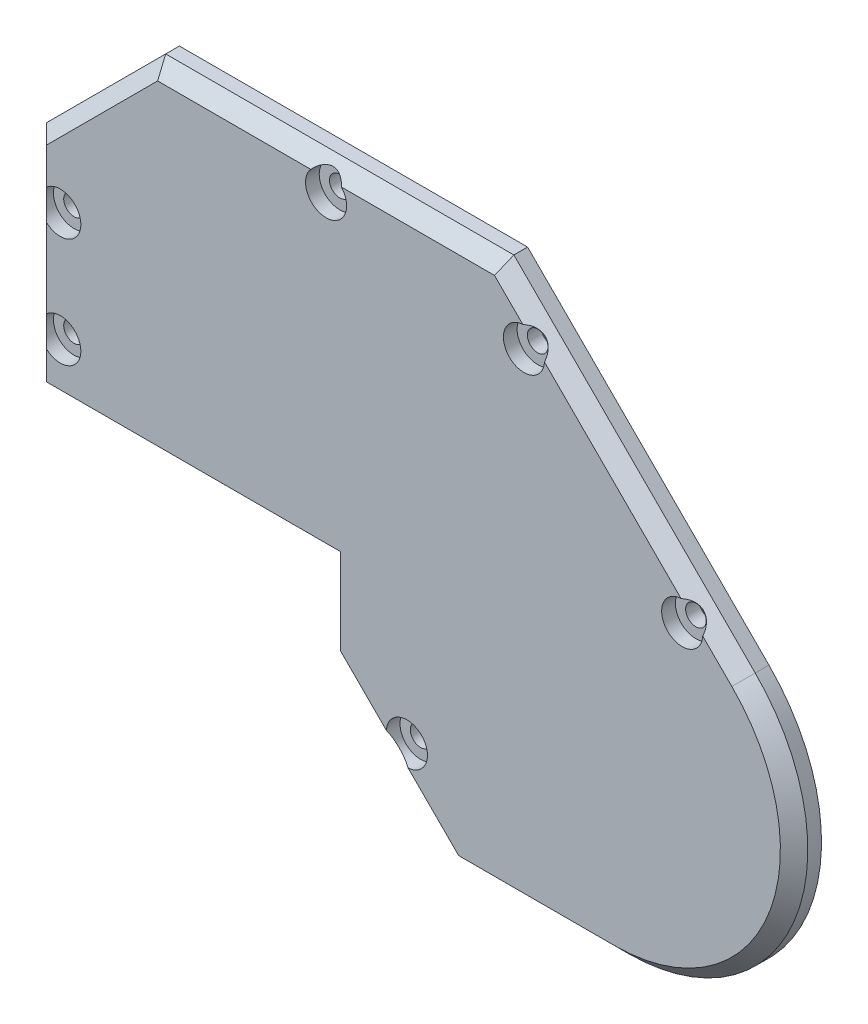
ISO-10303-21;
HEADER;
FILE_DESCRIPTION(('STEP AP214'),'2;1');
FILE_NAME('part.step','',(''),(''),'','','');
FILE_SCHEMA(('AUTOMOTIVE_DESIGN { 1 0 10303 214 1 1 1 1 }'));
ENDSEC;
DATA;
#1=APPLICATION_CONTEXT('core data for automotive mechanical design processes');
#2=APPLICATION_PROTOCOL_DEFINITION('international standard','automotive_design',2000,#1);
#3=PRODUCT_CONTEXT('',#1,'mechanical');
#4=PRODUCT('Part','Part','',(#3));
#5=PRODUCT_RELATED_PRODUCT_CATEGORY('part','',(#4));
#6=PRODUCT_DEFINITION_FORMATION('','',#4);
#7=PRODUCT_DEFINITION_CONTEXT('part definition',#1,'design');
#8=PRODUCT_DEFINITION('design','',#6,#7);
#9=PRODUCT_DEFINITION_SHAPE('','',#8);
#10=(LENGTH_UNIT() NAMED_UNIT(*) SI_UNIT(.MILLI.,.METRE.));
#11=(NAMED_UNIT(*) PLANE_ANGLE_UNIT() SI_UNIT($,.RADIAN.));
#12=(NAMED_UNIT(*) SI_UNIT($,.STERADIAN.) SOLID_ANGLE_UNIT());
#13=UNCERTAINTY_MEASURE_WITH_UNIT(LENGTH_MEASURE(1.E-05),#10,'distance_accuracy_value','');
#14=(GEOMETRIC_REPRESENTATION_CONTEXT(3) GLOBAL_UNCERTAINTY_ASSIGNED_CONTEXT((#13)) GLOBAL_UNIT_ASSIGNED_CONTEXT((#10,
#11,#12)) REPRESENTATION_CONTEXT('',''));
#15=CARTESIAN_POINT('',(0.,0.,0.));
#16=DIRECTION('',(0.,0.,1.));
#17=DIRECTION('',(1.,0.,0.));
#18=AXIS2_PLACEMENT_3D('',#15,#16,#17);
#19=CARTESIAN_POINT('',(91.5686996380855,17.926841446616,4.));
#20=DIRECTION('',(0.,0.,-1.));
#21=DIRECTION('',(1.,0.,0.));
#22=AXIS2_PLACEMENT_3D('',#19,#20,#21);
#23=CYLINDRICAL_SURFACE('',#22,1.5);
#24=CARTESIAN_POINT('',(91.5686996380855,17.926841446616,0.));
#25=DIRECTION('',(0.,0.,-1.));
#26=DIRECTION('',(-1.,0.,0.));
#27=AXIS2_PLACEMENT_3D('',#24,#25,#26);
#28=CIRCLE('',#27,1.5);
#29=CARTESIAN_POINT('',(90.0686996380855,17.926841446616,0.));
#30=VERTEX_POINT('',#29);
#31=EDGE_CURVE('E264',#30,#30,#28,.T.);
#32=ORIENTED_EDGE('',*,*,#31,.T.);
#33=EDGE_LOOP('',(#32));
#34=FACE_BOUND('',#33,.T.);
#35=CARTESIAN_POINT('',(91.5686996380855,17.926841446616,2.));
#36=DIRECTION('',(0.,0.,-1.));
#37=DIRECTION('',(-1.,0.,0.));
#38=AXIS2_PLACEMENT_3D('',#35,#36,#37);
#39=CIRCLE('',#38,1.5);
#40=CARTESIAN_POINT('',(90.0686996380855,17.926841446616,2.));
#41=VERTEX_POINT('',#40);
#42=EDGE_CURVE('E36',#41,#41,#39,.T.);
#43=ORIENTED_EDGE('',*,*,#42,.F.);
#44=EDGE_LOOP('',(#43));
#45=FACE_BOUND('',#44,.T.);
#46=ADVANCED_FACE('F32',(#34,#45),#23,.F.);
#47=CARTESIAN_POINT('',(51.3882684270139,-17.4117315730127,4.));
#48=DIRECTION('',(0.,0.,-1.));
#49=DIRECTION('',(1.,0.,0.));
#50=AXIS2_PLACEMENT_3D('',#47,#48,#49);
#51=CYLINDRICAL_SURFACE('',#50,1.5);
#52=CARTESIAN_POINT('',(51.3882684270139,-17.4117315730127,0.));
#53=DIRECTION('',(0.,0.,-1.));
#54=DIRECTION('',(-1.,0.,0.));
#55=AXIS2_PLACEMENT_3D('',#52,#53,#54);
#56=CIRCLE('',#55,1.5);
#57=CARTESIAN_POINT('',(49.8882684270139,-17.4117315730127,0.));
#58=VERTEX_POINT('',#57);
#59=EDGE_CURVE('E251',#58,#58,#56,.T.);
#60=ORIENTED_EDGE('',*,*,#59,.T.);
#61=EDGE_LOOP('',(#60));
#62=FACE_BOUND('',#61,.T.);
#63=CARTESIAN_POINT('',(51.3882684270139,-17.4117315730127,2.));
#64=DIRECTION('',(0.,0.,-1.));
#65=DIRECTION('',(-1.,0.,0.));
#66=AXIS2_PLACEMENT_3D('',#63,#64,#65);
#67=CIRCLE('',#66,1.5);
#68=CARTESIAN_POINT('',(49.8882684270139,-17.4117315730127,2.));
#69=VERTEX_POINT('',#68);
#70=EDGE_CURVE('E189',#69,#69,#67,.T.);
#71=ORIENTED_EDGE('',*,*,#70,.F.);
#72=EDGE_LOOP('',(#71));
#73=FACE_BOUND('',#72,.T.);
#74=ADVANCED_FACE('F385',(#62,#73),#51,.F.);
#75=CARTESIAN_POINT('',(68.4726534900144,41.022887594687,4.));
#76=DIRECTION('',(0.,0.,-1.));
#77=DIRECTION('',(1.,0.,0.));
#78=AXIS2_PLACEMENT_3D('',#75,#76,#77);
#79=CYLINDRICAL_SURFACE('',#78,1.5);
#80=CARTESIAN_POINT('',(68.4726534900144,41.022887594687,0.));
#81=DIRECTION('',(0.,0.,-1.));
#82=DIRECTION('',(-1.,0.,0.));
#83=AXIS2_PLACEMENT_3D('',#80,#81,#82);
#84=CIRCLE('',#83,1.5);
#85=CARTESIAN_POINT('',(66.9726534900144,41.022887594687,0.));
#86=VERTEX_POINT('',#85);
#87=EDGE_CURVE('E261',#86,#86,#84,.T.);
#88=ORIENTED_EDGE('',*,*,#87,.T.);
#89=EDGE_LOOP('',(#88));
#90=FACE_BOUND('',#89,.T.);
#91=CARTESIAN_POINT('',(68.4726534900144,41.022887594687,2.));
#92=DIRECTION('',(0.,0.,-1.));
#93=DIRECTION('',(-1.,0.,0.));
#94=AXIS2_PLACEMENT_3D('',#91,#92,#93);
#95=CIRCLE('',#94,1.5);
#96=CARTESIAN_POINT('',(66.9726534900144,41.022887594687,2.));
#97=VERTEX_POINT('',#96);
#98=EDGE_CURVE('E196',#97,#97,#95,.T.);
#99=ORIENTED_EDGE('',*,*,#98,.F.);
#100=EDGE_LOOP('',(#99));
#101=FACE_BOUND('',#100,.T.);
#102=ADVANCED_FACE('F387',(#90,#101),#79,.F.);
#103=CARTESIAN_POINT('',(39.5924878405,46.1490147738,4.));
#104=DIRECTION('',(0.,0.,-1.));
#105=DIRECTION('',(1.,0.,0.));
#106=AXIS2_PLACEMENT_3D('',#103,#104,#105);
#107=CYLINDRICAL_SURFACE('',#106,1.5);
#108=CARTESIAN_POINT('',(39.5924878405,46.1490147738,0.));
#109=DIRECTION('',(0.,0.,-1.));
#110=DIRECTION('',(-1.,0.,0.));
#111=AXIS2_PLACEMENT_3D('',#108,#109,#110);
#112=CIRCLE('',#111,1.5);
#113=CARTESIAN_POINT('',(38.0924878405,46.1490147738,0.));
#114=VERTEX_POINT('',#113);
#115=EDGE_CURVE('E258',#114,#114,#112,.T.);
#116=ORIENTED_EDGE('',*,*,#115,.T.);
#117=EDGE_LOOP('',(#116));
#118=FACE_BOUND('',#117,.T.);
#119=CARTESIAN_POINT('',(39.5924878405,46.1490147738,2.));
#120=DIRECTION('',(0.,0.,-1.));
#121=DIRECTION('',(-1.,0.,0.));
#122=AXIS2_PLACEMENT_3D('',#119,#120,#121);
#123=CIRCLE('',#122,1.5);
#124=CARTESIAN_POINT('',(38.0924878405,46.1490147738,2.));
#125=VERTEX_POINT('',#124);
#126=EDGE_CURVE('E203',#125,#125,#123,.T.);
#127=ORIENTED_EDGE('',*,*,#126,.F.);
#128=EDGE_LOOP('',(#127));
#129=FACE_BOUND('',#128,.T.);
#130=ADVANCED_FACE('F394',(#118,#129),#107,.F.);
#131=CARTESIAN_POINT('',(0.8,8.38370982659695,4.));
#132=DIRECTION('',(0.,0.,-1.));
#133=DIRECTION('',(1.,0.,0.));
#134=AXIS2_PLACEMENT_3D('',#131,#132,#133);
#135=CYLINDRICAL_SURFACE('',#134,1.5);
#136=CARTESIAN_POINT('',(0.8,8.38370982659695,0.));
#137=DIRECTION('',(0.,0.,-1.));
#138=DIRECTION('',(-1.,0.,0.));
#139=AXIS2_PLACEMENT_3D('',#136,#137,#138);
#140=CIRCLE('',#139,1.5);
#141=CARTESIAN_POINT('',(-0.699999999999999,8.38370982659695,0.));
#142=VERTEX_POINT('',#141);
#143=EDGE_CURVE('E248',#142,#142,#140,.T.);
#144=ORIENTED_EDGE('',*,*,#143,.T.);
#145=EDGE_LOOP('',(#144));
#146=FACE_BOUND('',#145,.T.);
#147=CARTESIAN_POINT('',(0.8,8.38370982659695,2.));
#148=DIRECTION('',(0.,0.,-1.));
#149=DIRECTION('',(-1.,0.,0.));
#150=AXIS2_PLACEMENT_3D('',#147,#148,#149);
#151=CIRCLE('',#150,1.5);
#152=CARTESIAN_POINT('',(-0.699999999999999,8.38370982659695,2.));
#153=VERTEX_POINT('',#152);
#154=EDGE_CURVE('E210',#153,#153,#151,.T.);
#155=ORIENTED_EDGE('',*,*,#154,.F.);
#156=EDGE_LOOP('',(#155));
#157=FACE_BOUND('',#156,.T.);
#158=ADVANCED_FACE('F401',(#146,#157),#135,.F.);
#159=CARTESIAN_POINT('',(0.8,24.383709826597,4.));
#160=DIRECTION('',(0.,0.,-1.));
#161=DIRECTION('',(1.,0.,0.));
#162=AXIS2_PLACEMENT_3D('',#159,#160,#161);
#163=CYLINDRICAL_SURFACE('',#162,1.5);
#164=CARTESIAN_POINT('',(0.8,24.383709826597,0.));
#165=DIRECTION('',(0.,0.,-1.));
#166=DIRECTION('',(-1.,0.,0.));
#167=AXIS2_PLACEMENT_3D('',#164,#165,#166);
#168=CIRCLE('',#167,1.5);
#169=CARTESIAN_POINT('',(-0.7,24.383709826597,0.));
#170=VERTEX_POINT('',#169);
#171=EDGE_CURVE('E255',#170,#170,#168,.T.);
#172=ORIENTED_EDGE('',*,*,#171,.T.);
#173=EDGE_LOOP('',(#172));
#174=FACE_BOUND('',#173,.T.);
#175=CARTESIAN_POINT('',(0.8,24.383709826597,2.));
#176=DIRECTION('',(0.,0.,-1.));
#177=DIRECTION('',(-1.,0.,0.));
#178=AXIS2_PLACEMENT_3D('',#175,#176,#177);
#179=CIRCLE('',#178,1.5);
#180=CARTESIAN_POINT('',(-0.7,24.383709826597,2.));
#181=VERTEX_POINT('',#180);
#182=EDGE_CURVE('E217',#181,#181,#179,.T.);
#183=ORIENTED_EDGE('',*,*,#182,.F.);
#184=EDGE_LOOP('',(#183));
#185=FACE_BOUND('',#184,.T.);
#186=ADVANCED_FACE('F403',(#174,#185),#163,.F.);
#187=CARTESIAN_POINT('',(39.,0.,-48.));
#188=DIRECTION('',(0.,1.,0.));
#189=DIRECTION('',(0.,0.,-1.));
#190=AXIS2_PLACEMENT_3D('',#187,#188,#189);
#191=PLANE('',#190);
#192=DIRECTION('',(0.,0.,1.));
#193=VECTOR('',#192,1.);
#194=CARTESIAN_POINT('',(39.7000000000247,0.,-48.));
#195=LINE('',#194,#193);
#196=CARTESIAN_POINT('',(39.7000000000247,0.,0.));
#197=VERTEX_POINT('',#196);
#198=CARTESIAN_POINT('',(39.7000000000247,0.,2.));
#199=VERTEX_POINT('',#198);
#200=EDGE_CURVE('E176',#197,#199,#195,.T.);
#201=ORIENTED_EDGE('',*,*,#200,.T.);
#202=DIRECTION('',(1.,0.,0.));
#203=VECTOR('',#202,1.);
#204=CARTESIAN_POINT('',(39.7000000000247,0.,2.));
#205=LINE('',#204,#203);
#206=CARTESIAN_POINT('',(-3.2,0.,2.));
#207=VERTEX_POINT('',#206);
#208=EDGE_CURVE('E328',#207,#199,#205,.T.);
#209=ORIENTED_EDGE('',*,*,#208,.F.);
#210=DIRECTION('',(0.,0.,1.));
#211=VECTOR('',#210,1.);
#212=CARTESIAN_POINT('',(-3.2,0.,-48.));
#213=LINE('',#212,#211);
#214=CARTESIAN_POINT('',(-3.2,0.,0.));
#215=VERTEX_POINT('',#214);
#216=EDGE_CURVE('E267',#215,#207,#213,.T.);
#217=ORIENTED_EDGE('',*,*,#216,.F.);
#218=DIRECTION('',(1.,0.,0.));
#219=VECTOR('',#218,1.);
#220=CARTESIAN_POINT('',(-3.2,0.,0.));
#221=LINE('',#220,#219);
#222=EDGE_CURVE('E241',#215,#197,#221,.T.);
#223=ORIENTED_EDGE('',*,*,#222,.T.);
#224=EDGE_LOOP('',(#201,#209,#217,#223));
#225=FACE_BOUND('',#224,.T.);
#226=ADVANCED_FACE('F406',(#225),#191,.F.);
#227=CARTESIAN_POINT('',(39.7000000000247,0.,-48.));
#228=DIRECTION('',(1.,0.,0.));
#229=DIRECTION('',(0.,0.,1.));
#230=AXIS2_PLACEMENT_3D('',#227,#228,#229);
#231=PLANE('',#230);
#232=DIRECTION('',(0.,0.,1.));
#233=VECTOR('',#232,1.);
#234=CARTESIAN_POINT('',(39.7000000000247,-11.3803173955159,-48.));
#235=LINE('',#234,#233);
#236=CARTESIAN_POINT('',(39.7000000000247,-11.3803173955159,0.));
#237=VERTEX_POINT('',#236);
#238=CARTESIAN_POINT('',(39.7000000000247,-11.3803173955159,2.));
#239=VERTEX_POINT('',#238);
#240=EDGE_CURVE('E288',#237,#239,#235,.T.);
#241=ORIENTED_EDGE('',*,*,#240,.T.);
#242=DIRECTION('',(0.,-1.,0.));
#243=VECTOR('',#242,1.);
#244=CARTESIAN_POINT('',(39.7000000000247,-11.3803173955159,2.));
#245=LINE('',#244,#243);
#246=EDGE_CURVE('E331',#199,#239,#245,.T.);
#247=ORIENTED_EDGE('',*,*,#246,.F.);
#248=ORIENTED_EDGE('',*,*,#200,.F.);
#249=DIRECTION('',(0.,-1.,0.));
#250=VECTOR('',#249,1.);
#251=CARTESIAN_POINT('',(39.7000000000247,0.,0.));
#252=LINE('',#251,#250);
#253=EDGE_CURVE('E238',#197,#237,#252,.T.);
#254=ORIENTED_EDGE('',*,*,#253,.T.);
#255=EDGE_LOOP('',(#241,#247,#248,#254));
#256=FACE_BOUND('',#255,.T.);
#257=ADVANCED_FACE('F444',(#256),#231,.F.);
#258=CARTESIAN_POINT('',(50.1824243043077,-21.8627416997989,-48.));
#259=DIRECTION('',(0.707106781186548,0.707106781186547,0.));
#260=DIRECTION('',(-0.707106781186547,0.707106781186548,0.));
#261=AXIS2_PLACEMENT_3D('',#258,#259,#260);
#262=PLANE('',#261);
#263=DIRECTION('',(0.,0.,1.));
#264=VECTOR('',#263,1.);
#265=CARTESIAN_POINT('',(58.1196826045108,-29.800000000002,-48.));
#266=LINE('',#265,#264);
#267=CARTESIAN_POINT('',(58.1196826045108,-29.800000000002,0.));
#268=VERTEX_POINT('',#267);
#269=CARTESIAN_POINT('',(58.1196826045108,-29.800000000002,2.));
#270=VERTEX_POINT('',#269);
#271=EDGE_CURVE('E285',#268,#270,#266,.T.);
#272=ORIENTED_EDGE('',*,*,#271,.T.);
#273=DIRECTION('',(0.707106781186547,-0.707106781186548,0.));
#274=VECTOR('',#273,1.);
#275=CARTESIAN_POINT('',(58.1196826045108,-29.800000000002,2.));
#276=LINE('',#275,#274);
#277=EDGE_CURVE('E334',#239,#270,#276,.T.);
#278=ORIENTED_EDGE('',*,*,#277,.F.);
#279=ORIENTED_EDGE('',*,*,#240,.F.);
#280=DIRECTION('',(0.707106781186548,-0.707106781186548,0.));
#281=VECTOR('',#280,1.);
#282=CARTESIAN_POINT('',(39.7000000000247,-11.3803173955159,0.));
#283=LINE('',#282,#281);
#284=EDGE_CURVE('E235',#237,#268,#283,.T.);
#285=ORIENTED_EDGE('',*,*,#284,.T.);
#286=EDGE_LOOP('',(#272,#278,#279,#285));
#287=FACE_BOUND('',#286,.T.);
#288=ADVANCED_FACE('F440',(#287),#262,.F.);
#289=CARTESIAN_POINT('',(81.7000000000047,-29.800000000002,-48.));
#290=DIRECTION('',(0.,1.,0.));
#291=DIRECTION('',(-1.,0.,0.));
#292=AXIS2_PLACEMENT_3D('',#289,#290,#291);
#293=PLANE('',#292);
#294=DIRECTION('',(0.,0.,1.));
#295=VECTOR('',#294,1.);
#296=CARTESIAN_POINT('',(81.7000000000047,-29.800000000002,-48.));
#297=LINE('',#296,#295);
#298=CARTESIAN_POINT('',(81.7000000000047,-29.800000000002,0.));
#299=VERTEX_POINT('',#298);
#300=CARTESIAN_POINT('',(81.7000000000047,-29.800000000002,2.));
#301=VERTEX_POINT('',#300);
#302=EDGE_CURVE('E282',#299,#301,#297,.T.);
#303=ORIENTED_EDGE('',*,*,#302,.T.);
#304=DIRECTION('',(1.,0.,0.));
#305=VECTOR('',#304,1.);
#306=CARTESIAN_POINT('',(81.7000000000047,-29.800000000002,2.));
#307=LINE('',#306,#305);
#308=EDGE_CURVE('E337',#270,#301,#307,.T.);
#309=ORIENTED_EDGE('',*,*,#308,.F.);
#310=ORIENTED_EDGE('',*,*,#271,.F.);
#311=DIRECTION('',(1.,0.,0.));
#312=VECTOR('',#311,1.);
#313=CARTESIAN_POINT('',(58.1196826045108,-29.800000000002,0.));
#314=LINE('',#313,#312);
#315=EDGE_CURVE('E232',#268,#299,#314,.T.);
#316=ORIENTED_EDGE('',*,*,#315,.T.);
#317=EDGE_LOOP('',(#303,#309,#310,#316));
#318=FACE_BOUND('',#317,.T.);
#319=ADVANCED_FACE('F436',(#318),#293,.F.);
#320=CARTESIAN_POINT('',(81.7000000000047,-3.59999999999532,-48.));
#321=DIRECTION('',(0.,0.,1.));
#322=DIRECTION('',(-1.,0.,0.));
#323=AXIS2_PLACEMENT_3D('',#320,#321,#322);
#324=CYLINDRICAL_SURFACE('',#323,26.2000000000067);
#325=DIRECTION('',(0.,0.,1.));
#326=VECTOR('',#325,1.);
#327=CARTESIAN_POINT('',(100.226197667097,14.9261976670969,-48.));
#328=LINE('',#327,#326);
#329=CARTESIAN_POINT('',(100.226197667097,14.9261976670969,0.));
#330=VERTEX_POINT('',#329);
#331=CARTESIAN_POINT('',(100.226197667097,14.9261976670969,2.00000000000001));
#332=VERTEX_POINT('',#331);
#333=EDGE_CURVE('E279',#330,#332,#328,.T.);
#334=ORIENTED_EDGE('',*,*,#333,.T.);
#335=CARTESIAN_POINT('',(81.7000000000047,-3.59999999999532,2.));
#336=DIRECTION('',(0.,0.,-1.));
#337=DIRECTION('',(-1.,0.,0.));
#338=AXIS2_PLACEMENT_3D('',#335,#336,#337);
#339=CIRCLE('',#338,26.2000000000067);
#340=EDGE_CURVE('E340',#301,#332,#339,.F.);
#341=ORIENTED_EDGE('',*,*,#340,.F.);
#342=ORIENTED_EDGE('',*,*,#302,.F.);
#343=CARTESIAN_POINT('',(81.7000000000047,-3.59999999999532,0.));
#344=DIRECTION('',(0.,0.,-1.));
#345=DIRECTION('',(-1.,0.,0.));
#346=AXIS2_PLACEMENT_3D('',#343,#344,#345);
#347=CIRCLE('',#346,26.2000000000067);
#348=EDGE_CURVE('E229',#299,#330,#347,.F.);
#349=ORIENTED_EDGE('',*,*,#348,.T.);
#350=EDGE_LOOP('',(#334,#341,#342,#349));
#351=FACE_BOUND('',#350,.T.);
#352=ADVANCED_FACE('F432',(#351),#324,.T.);
#353=CARTESIAN_POINT('',(100.226197667097,14.9261976670969,-48.));
#354=DIRECTION('',(-0.707106781186548,-0.707106781186547,0.));
#355=DIRECTION('',(0.707106781186547,-0.707106781186548,0.));
#356=AXIS2_PLACEMENT_3D('',#353,#354,#355);
#357=PLANE('',#356);
#358=DIRECTION('',(0.,0.,1.));
#359=VECTOR('',#358,1.);
#360=CARTESIAN_POINT('',(65.0033805603939,50.1490147738,-48.));
#361=LINE('',#360,#359);
#362=CARTESIAN_POINT('',(65.0033805603939,50.1490147738,0.));
#363=VERTEX_POINT('',#362);
#364=CARTESIAN_POINT('',(65.0033805603939,50.1490147738,2.00000000000001));
#365=VERTEX_POINT('',#364);
#366=EDGE_CURVE('E276',#363,#365,#361,.T.);
#367=ORIENTED_EDGE('',*,*,#366,.T.);
#368=DIRECTION('',(-0.707106781186547,0.707106781186548,0.));
#369=VECTOR('',#368,1.);
#370=CARTESIAN_POINT('',(65.0033805603939,50.1490147738,2.00000000000001));
#371=LINE('',#370,#369);
#372=EDGE_CURVE('E343',#332,#365,#371,.T.);
#373=ORIENTED_EDGE('',*,*,#372,.F.);
#374=ORIENTED_EDGE('',*,*,#333,.F.);
#375=DIRECTION('',(-0.707106781186547,0.707106781186548,0.));
#376=VECTOR('',#375,1.);
#377=CARTESIAN_POINT('',(100.226197667097,14.9261976670969,0.));
#378=LINE('',#377,#376);
#379=EDGE_CURVE('E225',#330,#363,#378,.T.);
#380=ORIENTED_EDGE('',*,*,#379,.T.);
#381=EDGE_LOOP('',(#367,#373,#374,#380));
#382=FACE_BOUND('',#381,.T.);
#383=ADVANCED_FACE('F428',(#382),#357,.F.);
#384=CARTESIAN_POINT('',(50.1111403346,50.1490147738,-48.));
#385=DIRECTION('',(0.,-1.,0.));
#386=DIRECTION('',(0.,0.,1.));
#387=AXIS2_PLACEMENT_3D('',#384,#385,#386);
#388=PLANE('',#387);
#389=DIRECTION('',(0.,0.,1.));
#390=VECTOR('',#389,1.);
#391=CARTESIAN_POINT('',(14.1815951206061,50.1490147738,-48.));
#392=LINE('',#391,#390);
#393=CARTESIAN_POINT('',(14.1815951206061,50.1490147738,0.));
#394=VERTEX_POINT('',#393);
#395=CARTESIAN_POINT('',(14.1815951206061,50.1490147738,2.));
#396=VERTEX_POINT('',#395);
#397=EDGE_CURVE('E273',#394,#396,#392,.T.);
#398=ORIENTED_EDGE('',*,*,#397,.T.);
#399=DIRECTION('',(-1.,0.,0.));
#400=VECTOR('',#399,1.);
#401=CARTESIAN_POINT('',(14.1815951206061,50.1490147738,2.));
#402=LINE('',#401,#400);
#403=EDGE_CURVE('E319',#365,#396,#402,.T.);
#404=ORIENTED_EDGE('',*,*,#403,.F.);
#405=ORIENTED_EDGE('',*,*,#366,.F.);
#406=DIRECTION('',(-1.,0.,0.));
#407=VECTOR('',#406,1.);
#408=CARTESIAN_POINT('',(65.0033805603939,50.1490147738,0.));
#409=LINE('',#408,#407);
#410=EDGE_CURVE('E221',#363,#394,#409,.T.);
#411=ORIENTED_EDGE('',*,*,#410,.T.);
#412=EDGE_LOOP('',(#398,#404,#405,#411));
#413=FACE_BOUND('',#412,.T.);
#414=ADVANCED_FACE('F424',(#413),#388,.F.);
#415=CARTESIAN_POINT('',(-3.2,32.7674196531939,-48.));
#416=DIRECTION('',(0.707106781186547,-0.707106781186547,0.));
#417=DIRECTION('',(0.707106781186548,0.707106781186548,0.));
#418=AXIS2_PLACEMENT_3D('',#415,#416,#417);
#419=PLANE('',#418);
#420=DIRECTION('',(0.,0.,1.));
#421=VECTOR('',#420,1.);
#422=CARTESIAN_POINT('',(-3.2,32.7674196531939,-48.));
#423=LINE('',#422,#421);
#424=CARTESIAN_POINT('',(-3.2,32.7674196531939,0.));
#425=VERTEX_POINT('',#424);
#426=CARTESIAN_POINT('',(-3.2,32.7674196531939,2.));
#427=VERTEX_POINT('',#426);
#428=EDGE_CURVE('E270',#425,#427,#423,.T.);
#429=ORIENTED_EDGE('',*,*,#428,.T.);
#430=DIRECTION('',(-0.707106781186548,-0.707106781186548,0.));
#431=VECTOR('',#430,1.);
#432=CARTESIAN_POINT('',(-3.2,32.7674196531939,2.));
#433=LINE('',#432,#431);
#434=EDGE_CURVE('E322',#396,#427,#433,.T.);
#435=ORIENTED_EDGE('',*,*,#434,.F.);
#436=ORIENTED_EDGE('',*,*,#397,.F.);
#437=DIRECTION('',(-0.707106781186548,-0.707106781186548,0.));
#438=VECTOR('',#437,1.);
#439=CARTESIAN_POINT('',(14.1815951206061,50.1490147738,0.));
#440=LINE('',#439,#438);
#441=EDGE_CURVE('E224',#394,#425,#440,.T.);
#442=ORIENTED_EDGE('',*,*,#441,.T.);
#443=EDGE_LOOP('',(#429,#435,#436,#442));
#444=FACE_BOUND('',#443,.T.);
#445=ADVANCED_FACE('F420',(#444),#419,.F.);
#446=CARTESIAN_POINT('',(-3.2,0.,-48.));
#447=DIRECTION('',(1.,0.,0.));
#448=DIRECTION('',(0.,0.,1.));
#449=AXIS2_PLACEMENT_3D('',#446,#447,#448);
#450=PLANE('',#449);
#451=ORIENTED_EDGE('',*,*,#216,.T.);
#452=DIRECTION('',(0.,-1.,0.));
#453=VECTOR('',#452,1.);
#454=CARTESIAN_POINT('',(-3.2,0.,2.));
#455=LINE('',#454,#453);
#456=EDGE_CURVE('E325',#427,#207,#455,.T.);
#457=ORIENTED_EDGE('',*,*,#456,.F.);
#458=ORIENTED_EDGE('',*,*,#428,.F.);
#459=DIRECTION('',(0.,-1.,0.));
#460=VECTOR('',#459,1.);
#461=CARTESIAN_POINT('',(-3.2,32.7674196531939,0.));
#462=LINE('',#461,#460);
#463=EDGE_CURVE('E244',#425,#215,#462,.T.);
#464=ORIENTED_EDGE('',*,*,#463,.T.);
#465=EDGE_LOOP('',(#451,#457,#458,#464));
#466=FACE_BOUND('',#465,.T.);
#467=ADVANCED_FACE('F414',(#466),#450,.F.);
#468=CARTESIAN_POINT('',(81.7000000000047,-3.59999999999532,4.));
#469=DIRECTION('',(0.,0.,1.));
#470=DIRECTION('',(-1.,0.,0.));
#471=AXIS2_PLACEMENT_3D('',#468,#469,#470);
#472=PLANE('',#471);
#473=CARTESIAN_POINT('',(91.5686996380855,17.926841446616,4.));
#474=DIRECTION('',(0.,0.,-1.));
#475=DIRECTION('',(-1.,0.,0.));
#476=AXIS2_PLACEMENT_3D('',#473,#474,#475);
#477=CIRCLE('',#476,3.00000000000001);
#478=CARTESIAN_POINT('',(94.5640520305428,17.7599161789049,4.));
#479=VERTEX_POINT('',#478);
#480=CARTESIAN_POINT('',(91.4017743703744,20.9221938390733,4.));
#481=VERTEX_POINT('',#480);
#482=EDGE_CURVE('E172',#479,#481,#477,.T.);
#483=ORIENTED_EDGE('',*,*,#482,.T.);
#484=DIRECTION('',(0.707106781186547,-0.707106781186548,0.));
#485=VECTOR('',#484,1.);
#486=CARTESIAN_POINT('',(98.8119841047239,13.5119841047238,4.));
#487=LINE('',#486,#485);
#488=CARTESIAN_POINT('',(71.4680058824717,40.855962326976,4.));
#489=VERTEX_POINT('',#488);
#490=EDGE_CURVE('E168',#489,#481,#487,.T.);
#491=ORIENTED_EDGE('',*,*,#490,.F.);
#492=CARTESIAN_POINT('',(68.4726534900144,41.022887594687,4.));
#493=DIRECTION('',(0.,0.,-1.));
#494=DIRECTION('',(-1.,0.,0.));
#495=AXIS2_PLACEMENT_3D('',#492,#493,#494);
#496=CIRCLE('',#495,3.00000000000001);
#497=CARTESIAN_POINT('',(68.3057282223034,44.0182399871443,4.));
#498=VERTEX_POINT('',#497);
#499=EDGE_CURVE('E197',#489,#498,#496,.T.);
#500=ORIENTED_EDGE('',*,*,#499,.T.);
#501=CARTESIAN_POINT('',(64.1749534356477,48.1490147738,4.));
#502=VERTEX_POINT('',#501);
#503=EDGE_CURVE('E178',#502,#498,#487,.T.);
#504=ORIENTED_EDGE('',*,*,#503,.F.);
#505=DIRECTION('',(1.,0.,0.));
#506=VECTOR('',#505,1.);
#507=CARTESIAN_POINT('',(65.0033805603939,48.1490147738,4.));
#508=LINE('',#507,#506);
#509=CARTESIAN_POINT('',(41.8285558179998,48.1490147738,4.));
#510=VERTEX_POINT('',#509);
#511=EDGE_CURVE('E315',#510,#502,#508,.T.);
#512=ORIENTED_EDGE('',*,*,#511,.F.);
#513=CARTESIAN_POINT('',(39.5924878405,46.1490147738,4.));
#514=DIRECTION('',(0.,0.,-1.));
#515=DIRECTION('',(-1.,0.,0.));
#516=AXIS2_PLACEMENT_3D('',#513,#514,#515);
#517=CIRCLE('',#516,3.);
#518=CARTESIAN_POINT('',(37.3564198630002,48.1490147738,4.));
#519=VERTEX_POINT('',#518);
#520=EDGE_CURVE('E204',#510,#519,#517,.T.);
#521=ORIENTED_EDGE('',*,*,#520,.T.);
#522=CARTESIAN_POINT('',(15.0100222453523,48.1490147738,4.));
#523=VERTEX_POINT('',#522);
#524=EDGE_CURVE('E316',#523,#519,#508,.T.);
#525=ORIENTED_EDGE('',*,*,#524,.F.);
#526=DIRECTION('',(0.707106781186548,0.707106781186548,0.));
#527=VECTOR('',#526,1.);
#528=CARTESIAN_POINT('',(15.5958086829792,48.7348012114269,4.));
#529=LINE('',#528,#527);
#530=CARTESIAN_POINT('',(-1.20000000000001,31.9389925284477,4.));
#531=VERTEX_POINT('',#530);
#532=EDGE_CURVE('E311',#531,#523,#529,.T.);
#533=ORIENTED_EDGE('',*,*,#532,.F.);
#534=DIRECTION('',(0.,1.,0.));
#535=VECTOR('',#534,1.);
#536=CARTESIAN_POINT('',(-1.20000000000001,32.7674196531939,4.));
#537=LINE('',#536,#535);
#538=CARTESIAN_POINT('',(-1.20000000000001,26.6197778040967,4.));
#539=VERTEX_POINT('',#538);
#540=EDGE_CURVE('E307',#539,#531,#537,.T.);
#541=ORIENTED_EDGE('',*,*,#540,.F.);
#542=CARTESIAN_POINT('',(0.8,24.383709826597,4.));
#543=DIRECTION('',(0.,0.,-1.));
#544=DIRECTION('',(-1.,0.,0.));
#545=AXIS2_PLACEMENT_3D('',#542,#543,#544);
#546=CIRCLE('',#545,3.);
#547=CARTESIAN_POINT('',(-1.20000000000001,22.1476418490972,4.));
#548=VERTEX_POINT('',#547);
#549=EDGE_CURVE('E218',#539,#548,#546,.T.);
#550=ORIENTED_EDGE('',*,*,#549,.T.);
#551=CARTESIAN_POINT('',(-1.20000000000001,10.6197778040967,4.));
#552=VERTEX_POINT('',#551);
#553=EDGE_CURVE('E312',#552,#548,#537,.T.);
#554=ORIENTED_EDGE('',*,*,#553,.F.);
#555=CARTESIAN_POINT('',(0.8,8.38370982659695,4.));
#556=DIRECTION('',(0.,0.,-1.));
#557=DIRECTION('',(-1.,0.,0.));
#558=AXIS2_PLACEMENT_3D('',#555,#556,#557);
#559=CIRCLE('',#558,3.);
#560=CARTESIAN_POINT('',(-1.20000000000001,6.14764184909717,4.));
#561=VERTEX_POINT('',#560);
#562=EDGE_CURVE('E211',#552,#561,#559,.T.);
#563=ORIENTED_EDGE('',*,*,#562,.T.);
#564=CARTESIAN_POINT('',(-1.20000000000001,2.,4.));
#565=VERTEX_POINT('',#564);
#566=EDGE_CURVE('E308',#565,#561,#537,.T.);
#567=ORIENTED_EDGE('',*,*,#566,.F.);
#568=DIRECTION('',(-1.,0.,0.));
#569=VECTOR('',#568,1.);
#570=CARTESIAN_POINT('',(-3.2,2.,4.));
#571=LINE('',#570,#569);
#572=CARTESIAN_POINT('',(41.7000000000247,2.,4.));
#573=VERTEX_POINT('',#572);
#574=EDGE_CURVE('E304',#573,#565,#571,.T.);
#575=ORIENTED_EDGE('',*,*,#574,.F.);
#576=DIRECTION('',(0.,1.,0.));
#577=VECTOR('',#576,1.);
#578=CARTESIAN_POINT('',(41.7000000000247,0.,4.));
#579=LINE('',#578,#577);
#580=CARTESIAN_POINT('',(41.7000000000247,-10.5518902707697,4.));
#581=VERTEX_POINT('',#580);
#582=EDGE_CURVE('E301',#581,#573,#579,.T.);
#583=ORIENTED_EDGE('',*,*,#582,.F.);
#584=DIRECTION('',(-0.707106781186547,0.707106781186548,0.));
#585=VECTOR('',#584,1.);
#586=CARTESIAN_POINT('',(41.1142135623978,-9.96610383314278,4.));
#587=LINE('',#586,#585);
#588=CARTESIAN_POINT('',(48.3929160345566,-17.2448063053017,4.));
#589=VERTEX_POINT('',#588);
#590=EDGE_CURVE('E298',#589,#581,#587,.T.);
#591=ORIENTED_EDGE('',*,*,#590,.F.);
#592=CARTESIAN_POINT('',(51.3882684270139,-17.4117315730127,4.));
#593=DIRECTION('',(0.,0.,-1.));
#594=DIRECTION('',(-1.,0.,0.));
#595=AXIS2_PLACEMENT_3D('',#592,#593,#594);
#596=CIRCLE('',#595,3.);
#597=CARTESIAN_POINT('',(51.555193694725,-20.40708396547,4.));
#598=VERTEX_POINT('',#597);
#599=EDGE_CURVE('E190',#589,#598,#596,.T.);
#600=ORIENTED_EDGE('',*,*,#599,.T.);
#601=CARTESIAN_POINT('',(58.948109729257,-27.800000000002,4.));
#602=VERTEX_POINT('',#601);
#603=EDGE_CURVE('E299',#602,#598,#587,.T.);
#604=ORIENTED_EDGE('',*,*,#603,.F.);
#605=DIRECTION('',(-1.,0.,0.));
#606=VECTOR('',#605,1.);
#607=CARTESIAN_POINT('',(58.1196826045108,-27.800000000002,4.));
#608=LINE('',#607,#606);
#609=CARTESIAN_POINT('',(81.7000000000047,-27.800000000002,4.));
#610=VERTEX_POINT('',#609);
#611=EDGE_CURVE('E295',#610,#602,#608,.T.);
#612=ORIENTED_EDGE('',*,*,#611,.F.);
#613=CARTESIAN_POINT('',(81.7000000000047,-3.59999999999532,4.));
#614=DIRECTION('',(0.,0.,-1.));
#615=DIRECTION('',(-1.,0.,0.));
#616=AXIS2_PLACEMENT_3D('',#613,#614,#615);
#617=CIRCLE('',#616,24.2000000000067);
#618=CARTESIAN_POINT('',(98.8119841047239,13.5119841047238,4.));
#619=VERTEX_POINT('',#618);
#620=EDGE_CURVE('E175',#619,#610,#617,.T.);
#621=ORIENTED_EDGE('',*,*,#620,.F.);
#622=EDGE_CURVE('E165',#479,#619,#487,.T.);
#623=ORIENTED_EDGE('',*,*,#622,.F.);
#624=EDGE_LOOP('',(#483,#491,#500,#504,#512,#521,#525,#533,#541,#550,#554,#563,#567,#575,#583,
#591,#600,#604,#612,#621,#623));
#625=FACE_BOUND('',#624,.T.);
#626=ADVANCED_FACE('F171',(#625),#472,.T.);
#627=CARTESIAN_POINT('',(81.7000000000047,-3.59999999999532,0.));
#628=DIRECTION('',(0.,0.,1.));
#629=DIRECTION('',(-1.,0.,0.));
#630=AXIS2_PLACEMENT_3D('',#627,#628,#629);
#631=PLANE('',#630);
#632=ORIENTED_EDGE('',*,*,#87,.F.);
#633=EDGE_LOOP('',(#632));
#634=FACE_BOUND('',#633,.T.);
#635=ORIENTED_EDGE('',*,*,#59,.F.);
#636=EDGE_LOOP('',(#635));
#637=FACE_BOUND('',#636,.T.);
#638=ORIENTED_EDGE('',*,*,#31,.F.);
#639=EDGE_LOOP('',(#638));
#640=FACE_BOUND('',#639,.T.);
#641=ORIENTED_EDGE('',*,*,#115,.F.);
#642=EDGE_LOOP('',(#641));
#643=FACE_BOUND('',#642,.T.);
#644=ORIENTED_EDGE('',*,*,#171,.F.);
#645=EDGE_LOOP('',(#644));
#646=FACE_BOUND('',#645,.T.);
#647=ORIENTED_EDGE('',*,*,#143,.F.);
#648=EDGE_LOOP('',(#647));
#649=FACE_BOUND('',#648,.T.);
#650=ORIENTED_EDGE('',*,*,#379,.F.);
#651=ORIENTED_EDGE('',*,*,#348,.F.);
#652=ORIENTED_EDGE('',*,*,#315,.F.);
#653=ORIENTED_EDGE('',*,*,#284,.F.);
#654=ORIENTED_EDGE('',*,*,#253,.F.);
#655=ORIENTED_EDGE('',*,*,#222,.F.);
#656=ORIENTED_EDGE('',*,*,#463,.F.);
#657=ORIENTED_EDGE('',*,*,#441,.F.);
#658=ORIENTED_EDGE('',*,*,#410,.F.);
#659=EDGE_LOOP('',(#650,#651,#652,#653,#654,#655,#656,#657,#658));
#660=FACE_BOUND('',#659,.T.);
#661=ADVANCED_FACE('F413',(#634,#637,#640,#643,#646,#649,#660),#631,.F.);
#662=CARTESIAN_POINT('',(41.7000000000247,-3.59999999999532,4.));
#663=DIRECTION('',(-0.707106781186548,0.,0.707106781186547));
#664=DIRECTION('',(0.,-1.,0.));
#665=AXIS2_PLACEMENT_3D('',#662,#663,#664);
#666=PLANE('',#665);
#667=DIRECTION('',(0.577350269189625,0.577350269189626,0.577350269189626));
#668=VECTOR('',#667,1.);
#669=CARTESIAN_POINT('',(55.0333333333513,15.3333333333266,17.3333333333267));
#670=LINE('',#669,#668);
#671=EDGE_CURVE('E360',#573,#199,#670,.F.);
#672=ORIENTED_EDGE('',*,*,#671,.T.);
#673=ORIENTED_EDGE('',*,*,#246,.T.);
#674=DIRECTION('',(0.678598344545847,0.281084637714819,0.678598344545848));
#675=VECTOR('',#674,1.);
#676=CARTESIAN_POINT('',(46.1573992172422,-8.70557506208695,8.45739921721757));
#677=LINE('',#676,#675);
#678=EDGE_CURVE('E252',#239,#581,#677,.T.);
#679=ORIENTED_EDGE('',*,*,#678,.T.);
#680=ORIENTED_EDGE('',*,*,#582,.T.);
#681=EDGE_LOOP('',(#672,#673,#679,#680));
#682=FACE_BOUND('',#681,.T.);
#683=ADVANCED_FACE('F34',(#682),#666,.T.);
#684=CARTESIAN_POINT('',(58.2240548646275,-27.0759451353725,4.));
#685=DIRECTION('',(-0.500000000000001,-0.5,0.707106781186546));
#686=DIRECTION('',(0.707106781186547,-0.707106781186548,0.));
#687=AXIS2_PLACEMENT_3D('',#684,#685,#686);
#688=PLANE('',#687);
#689=CARTESIAN_POINT('',(51.3882684270139,-17.4117315730127,6.00000000000002));
#690=DIRECTION('',(0.500000000000001,0.5,-0.707106781186546));
#691=DIRECTION('',(0.5,0.499999999999999,0.707106781186549));
#692=AXIS2_PLACEMENT_3D('',#689,#690,#691);
#693=ELLIPSE('',#692,4.24264068711929,3.);
#694=EDGE_CURVE('E41',#598,#589,#693,.T.);
#695=ORIENTED_EDGE('',*,*,#694,.T.);
#696=ORIENTED_EDGE('',*,*,#590,.T.);
#697=ORIENTED_EDGE('',*,*,#678,.F.);
#698=ORIENTED_EDGE('',*,*,#277,.T.);
#699=DIRECTION('',(0.281084637714819,0.678598344545846,0.678598344545848));
#700=VECTOR('',#699,1.);
#701=CARTESIAN_POINT('',(60.7457041253258,-23.4602232293667,8.33977677063528));
#702=LINE('',#701,#700);
#703=EDGE_CURVE('E358',#270,#602,#702,.T.);
#704=ORIENTED_EDGE('',*,*,#703,.T.);
#705=ORIENTED_EDGE('',*,*,#603,.T.);
#706=EDGE_LOOP('',(#695,#696,#697,#698,#704,#705));
#707=FACE_BOUND('',#706,.T.);
#708=ADVANCED_FACE('F477',(#707),#688,.T.);
#709=CARTESIAN_POINT('',(81.7000000000047,2.,4.));
#710=DIRECTION('',(0.,-0.707106781186548,0.707106781186547));
#711=DIRECTION('',(1.,0.,0.));
#712=AXIS2_PLACEMENT_3D('',#709,#710,#711);
#713=PLANE('',#712);
#714=ORIENTED_EDGE('',*,*,#671,.F.);
#715=ORIENTED_EDGE('',*,*,#574,.T.);
#716=DIRECTION('',(0.577350269189625,0.577350269189626,0.577350269189627));
#717=VECTOR('',#716,1.);
#718=CARTESIAN_POINT('',(26.4333333333348,29.6333333333349,31.6333333333349));
#719=LINE('',#718,#717);
#720=EDGE_CURVE('E356',#565,#207,#719,.F.);
#721=ORIENTED_EDGE('',*,*,#720,.T.);
#722=ORIENTED_EDGE('',*,*,#208,.T.);
#723=EDGE_LOOP('',(#714,#715,#721,#722));
#724=FACE_BOUND('',#723,.T.);
#725=ADVANCED_FACE('F474',(#724),#713,.T.);
#726=CARTESIAN_POINT('',(81.7000000000047,-27.800000000002,4.));
#727=DIRECTION('',(0.,-0.707106781186548,0.707106781186547));
#728=DIRECTION('',(1.,0.,0.));
#729=AXIS2_PLACEMENT_3D('',#726,#727,#728);
#730=PLANE('',#729);
#731=ORIENTED_EDGE('',*,*,#703,.F.);
#732=ORIENTED_EDGE('',*,*,#308,.T.);
#733=DIRECTION('',(0.,0.707106781186547,0.707106781186548));
#734=VECTOR('',#733,1.);
#735=CARTESIAN_POINT('',(81.7000000000047,-29.800000000002,2.));
#736=LINE('',#735,#734);
#737=EDGE_CURVE('E354',#301,#610,#736,.T.);
#738=ORIENTED_EDGE('',*,*,#737,.T.);
#739=ORIENTED_EDGE('',*,*,#611,.T.);
#740=EDGE_LOOP('',(#731,#732,#738,#739));
#741=FACE_BOUND('',#740,.T.);
#742=ADVANCED_FACE('F470',(#741),#730,.T.);
#743=CARTESIAN_POINT('',(-1.20000000000001,-3.59999999999532,4.));
#744=DIRECTION('',(-0.707106781186548,0.,0.707106781186547));
#745=DIRECTION('',(0.,-1.,0.));
#746=AXIS2_PLACEMENT_3D('',#743,#744,#745);
#747=PLANE('',#746);
#748=CARTESIAN_POINT('',(0.8,8.38370982659695,6.00000000000001));
#749=DIRECTION('',(0.707106781186548,0.,-0.707106781186547));
#750=DIRECTION('',(0.707106781186547,0.,0.707106781186548));
#751=AXIS2_PLACEMENT_3D('',#748,#749,#750);
#752=ELLIPSE('',#751,4.24264068711929,3.);
#753=EDGE_CURVE('E364',#561,#552,#752,.T.);
#754=ORIENTED_EDGE('',*,*,#753,.T.);
#755=ORIENTED_EDGE('',*,*,#553,.T.);
#756=CARTESIAN_POINT('',(0.8,24.383709826597,6.00000000000001));
#757=DIRECTION('',(0.707106781186548,0.,-0.707106781186547));
#758=DIRECTION('',(0.707106781186547,0.,0.707106781186548));
#759=AXIS2_PLACEMENT_3D('',#756,#757,#758);
#760=ELLIPSE('',#759,4.24264068711929,3.);
#761=EDGE_CURVE('E346',#548,#539,#760,.T.);
#762=ORIENTED_EDGE('',*,*,#761,.T.);
#763=ORIENTED_EDGE('',*,*,#540,.T.);
#764=DIRECTION('',(0.678598344545845,-0.281084637714824,0.678598344545847));
#765=VECTOR('',#764,1.);
#766=CARTESIAN_POINT('',(5.57883430305639,29.1311074230417,10.7788343030564));
#767=LINE('',#766,#765);
#768=EDGE_CURVE('E352',#531,#427,#767,.F.);
#769=ORIENTED_EDGE('',*,*,#768,.T.);
#770=ORIENTED_EDGE('',*,*,#456,.T.);
#771=ORIENTED_EDGE('',*,*,#720,.F.);
#772=ORIENTED_EDGE('',*,*,#566,.T.);
#773=EDGE_LOOP('',(#754,#755,#762,#763,#769,#770,#771,#772));
#774=FACE_BOUND('',#773,.T.);
#775=ADVANCED_FACE('F466',(#774),#747,.T.);
#776=CARTESIAN_POINT('',(81.7000000000047,-3.59999999999532,4.));
#777=DIRECTION('',(0.,0.,-1.));
#778=DIRECTION('',(1.,0.,0.));
#779=AXIS2_PLACEMENT_3D('',#776,#777,#778);
#780=CONICAL_SURFACE('',#779,24.2000000000067,0.785398163397447);
#781=ORIENTED_EDGE('',*,*,#737,.F.);
#782=ORIENTED_EDGE('',*,*,#340,.T.);
#783=DIRECTION('',(-0.499999999999999,-0.499999999999999,0.707106781186549));
#784=VECTOR('',#783,1.);
#785=CARTESIAN_POINT('',(100.226197667097,14.9261976670969,2.));
#786=LINE('',#785,#784);
#787=EDGE_CURVE('E350',#332,#619,#786,.T.);
#788=ORIENTED_EDGE('',*,*,#787,.T.);
#789=ORIENTED_EDGE('',*,*,#620,.T.);
#790=EDGE_LOOP('',(#781,#782,#788,#789));
#791=FACE_BOUND('',#790,.T.);
#792=ADVANCED_FACE('F462',(#791),#780,.T.);
#793=CARTESIAN_POINT('',(22.4805037357808,55.6194962642285,4.));
#794=DIRECTION('',(-0.5,0.5,0.707106781186548));
#795=DIRECTION('',(-0.707106781186548,-0.707106781186548,0.));
#796=AXIS2_PLACEMENT_3D('',#793,#794,#795);
#797=PLANE('',#796);
#798=ORIENTED_EDGE('',*,*,#768,.F.);
#799=ORIENTED_EDGE('',*,*,#532,.T.);
#800=DIRECTION('',(0.281084637714823,-0.678598344545846,0.678598344545847));
#801=VECTOR('',#800,1.);
#802=CARTESIAN_POINT('',(14.1753080238746,50.164193167997,1.98482160580296));
#803=LINE('',#802,#801);
#804=EDGE_CURVE('E348',#523,#396,#803,.F.);
#805=ORIENTED_EDGE('',*,*,#804,.T.);
#806=ORIENTED_EDGE('',*,*,#434,.T.);
#807=EDGE_LOOP('',(#798,#799,#805,#806));
#808=FACE_BOUND('',#807,.T.);
#809=ADVANCED_FACE('F459',(#808),#797,.T.);
#810=CARTESIAN_POINT('',(98.8119841047239,13.5119841047239,4.));
#811=DIRECTION('',(0.5,0.5,0.707106781186547));
#812=DIRECTION('',(-0.707106781186547,0.707106781186548,0.));
#813=AXIS2_PLACEMENT_3D('',#810,#811,#812);
#814=PLANE('',#813);
#815=CARTESIAN_POINT('',(91.5686996380855,17.926841446616,5.99999999999999));
#816=DIRECTION('',(-0.5,-0.5,-0.707106781186547));
#817=DIRECTION('',(-0.5,-0.5,0.707106781186548));
#818=AXIS2_PLACEMENT_3D('',#815,#816,#817);
#819=ELLIPSE('',#818,4.2426406871193,3.00000000000001);
#820=EDGE_CURVE('E11',#481,#479,#819,.T.);
#821=ORIENTED_EDGE('',*,*,#820,.T.);
#822=ORIENTED_EDGE('',*,*,#622,.T.);
#823=ORIENTED_EDGE('',*,*,#787,.F.);
#824=ORIENTED_EDGE('',*,*,#372,.T.);
#825=DIRECTION('',(0.28108463771482,0.678598344545846,-0.678598344545848));
#826=VECTOR('',#825,1.);
#827=CARTESIAN_POINT('',(60.3047849429905,38.8056015101579,13.3434132636421));
#828=LINE('',#827,#826);
#829=EDGE_CURVE('E228',#365,#502,#828,.F.);
#830=ORIENTED_EDGE('',*,*,#829,.T.);
#831=ORIENTED_EDGE('',*,*,#503,.T.);
#832=CARTESIAN_POINT('',(68.4726534900144,41.022887594687,6.00000000000004));
#833=DIRECTION('',(-0.5,-0.5,-0.707106781186547));
#834=DIRECTION('',(-0.5,-0.5,0.707106781186548));
#835=AXIS2_PLACEMENT_3D('',#832,#833,#834);
#836=ELLIPSE('',#835,4.2426406871193,3.00000000000001);
#837=EDGE_CURVE('E372',#498,#489,#836,.T.);
#838=ORIENTED_EDGE('',*,*,#837,.T.);
#839=ORIENTED_EDGE('',*,*,#490,.T.);
#840=EDGE_LOOP('',(#821,#822,#823,#824,#830,#831,#838,#839));
#841=FACE_BOUND('',#840,.T.);
#842=ADVANCED_FACE('F164',(#841),#814,.T.);
#843=CARTESIAN_POINT('',(81.7000000000047,48.1490147738,4.));
#844=DIRECTION('',(0.,0.707106781186548,0.707106781186547));
#845=DIRECTION('',(-1.,0.,0.));
#846=AXIS2_PLACEMENT_3D('',#843,#844,#845);
#847=PLANE('',#846);
#848=CARTESIAN_POINT('',(39.5924878405,46.1490147738,6.00000000000001));
#849=DIRECTION('',(0.,-0.707106781186548,-0.707106781186547));
#850=DIRECTION('',(0.,-0.707106781186547,0.707106781186548));
#851=AXIS2_PLACEMENT_3D('',#848,#849,#850);
#852=ELLIPSE('',#851,4.24264068711929,3.);
#853=EDGE_CURVE('E368',#519,#510,#852,.T.);
#854=ORIENTED_EDGE('',*,*,#853,.T.);
#855=ORIENTED_EDGE('',*,*,#511,.T.);
#856=ORIENTED_EDGE('',*,*,#829,.F.);
#857=ORIENTED_EDGE('',*,*,#403,.T.);
#858=ORIENTED_EDGE('',*,*,#804,.F.);
#859=ORIENTED_EDGE('',*,*,#524,.T.);
#860=EDGE_LOOP('',(#854,#855,#856,#857,#858,#859));
#861=FACE_BOUND('',#860,.T.);
#862=ADVANCED_FACE('F452',(#861),#847,.T.);
#863=CARTESIAN_POINT('',(0.8,24.383709826597,2.));
#864=DIRECTION('',(0.,0.,1.));
#865=DIRECTION('',(-1.,0.,0.));
#866=AXIS2_PLACEMENT_3D('',#863,#864,#865);
#867=CYLINDRICAL_SURFACE('',#866,3.);
#868=ORIENTED_EDGE('',*,*,#761,.F.);
#869=ORIENTED_EDGE('',*,*,#549,.F.);
#870=EDGE_LOOP('',(#868,#869));
#871=FACE_BOUND('',#870,.T.);
#872=CARTESIAN_POINT('',(0.8,24.383709826597,2.));
#873=DIRECTION('',(0.,0.,-1.));
#874=DIRECTION('',(-1.,0.,0.));
#875=AXIS2_PLACEMENT_3D('',#872,#873,#874);
#876=CIRCLE('',#875,3.);
#877=CARTESIAN_POINT('',(-2.2,24.383709826597,2.));
#878=VERTEX_POINT('',#877);
#879=EDGE_CURVE('E214',#878,#878,#876,.T.);
#880=ORIENTED_EDGE('',*,*,#879,.T.);
#881=EDGE_LOOP('',(#880));
#882=FACE_BOUND('',#881,.T.);
#883=ADVANCED_FACE('F455',(#871,#882),#867,.F.);
#884=CARTESIAN_POINT('',(0.8,24.383709826597,2.));
#885=DIRECTION('',(0.,0.,1.));
#886=DIRECTION('',(-1.,0.,0.));
#887=AXIS2_PLACEMENT_3D('',#884,#885,#886);
#888=PLANE('',#887);
#889=ORIENTED_EDGE('',*,*,#182,.T.);
#890=EDGE_LOOP('',(#889));
#891=FACE_BOUND('',#890,.T.);
#892=ORIENTED_EDGE('',*,*,#879,.F.);
#893=EDGE_LOOP('',(#892));
#894=FACE_BOUND('',#893,.T.);
#895=ADVANCED_FACE('F541',(#891,#894),#888,.T.);
#896=CARTESIAN_POINT('',(0.8,8.38370982659695,2.));
#897=DIRECTION('',(0.,0.,1.));
#898=DIRECTION('',(-1.,0.,0.));
#899=AXIS2_PLACEMENT_3D('',#896,#897,#898);
#900=CYLINDRICAL_SURFACE('',#899,3.);
#901=ORIENTED_EDGE('',*,*,#753,.F.);
#902=ORIENTED_EDGE('',*,*,#562,.F.);
#903=EDGE_LOOP('',(#901,#902));
#904=FACE_BOUND('',#903,.T.);
#905=CARTESIAN_POINT('',(0.8,8.38370982659695,2.));
#906=DIRECTION('',(0.,0.,-1.));
#907=DIRECTION('',(-1.,0.,0.));
#908=AXIS2_PLACEMENT_3D('',#905,#906,#907);
#909=CIRCLE('',#908,3.);
#910=CARTESIAN_POINT('',(-2.2,8.38370982659695,2.));
#911=VERTEX_POINT('',#910);
#912=EDGE_CURVE('E207',#911,#911,#909,.T.);
#913=ORIENTED_EDGE('',*,*,#912,.T.);
#914=EDGE_LOOP('',(#913));
#915=FACE_BOUND('',#914,.T.);
#916=ADVANCED_FACE('F537',(#904,#915),#900,.F.);
#917=CARTESIAN_POINT('',(0.8,8.38370982659695,2.));
#918=DIRECTION('',(0.,0.,1.));
#919=DIRECTION('',(-1.,0.,0.));
#920=AXIS2_PLACEMENT_3D('',#917,#918,#919);
#921=PLANE('',#920);
#922=ORIENTED_EDGE('',*,*,#154,.T.);
#923=EDGE_LOOP('',(#922));
#924=FACE_BOUND('',#923,.T.);
#925=ORIENTED_EDGE('',*,*,#912,.F.);
#926=EDGE_LOOP('',(#925));
#927=FACE_BOUND('',#926,.T.);
#928=ADVANCED_FACE('F533',(#924,#927),#921,.T.);
#929=CARTESIAN_POINT('',(39.5924878405,46.1490147738,2.));
#930=DIRECTION('',(0.,0.,1.));
#931=DIRECTION('',(-1.,0.,0.));
#932=AXIS2_PLACEMENT_3D('',#929,#930,#931);
#933=CYLINDRICAL_SURFACE('',#932,3.);
#934=ORIENTED_EDGE('',*,*,#853,.F.);
#935=ORIENTED_EDGE('',*,*,#520,.F.);
#936=EDGE_LOOP('',(#934,#935));
#937=FACE_BOUND('',#936,.T.);
#938=CARTESIAN_POINT('',(39.5924878405,46.1490147738,2.));
#939=DIRECTION('',(0.,0.,-1.));
#940=DIRECTION('',(-1.,0.,0.));
#941=AXIS2_PLACEMENT_3D('',#938,#939,#940);
#942=CIRCLE('',#941,3.);
#943=CARTESIAN_POINT('',(36.5924878405,46.1490147738,2.));
#944=VERTEX_POINT('',#943);
#945=EDGE_CURVE('E200',#944,#944,#942,.T.);
#946=ORIENTED_EDGE('',*,*,#945,.T.);
#947=EDGE_LOOP('',(#946));
#948=FACE_BOUND('',#947,.T.);
#949=ADVANCED_FACE('F529',(#937,#948),#933,.F.);
#950=CARTESIAN_POINT('',(39.5924878405,46.1490147738,2.));
#951=DIRECTION('',(0.,0.,1.));
#952=DIRECTION('',(-1.,0.,0.));
#953=AXIS2_PLACEMENT_3D('',#950,#951,#952);
#954=PLANE('',#953);
#955=ORIENTED_EDGE('',*,*,#126,.T.);
#956=EDGE_LOOP('',(#955));
#957=FACE_BOUND('',#956,.T.);
#958=ORIENTED_EDGE('',*,*,#945,.F.);
#959=EDGE_LOOP('',(#958));
#960=FACE_BOUND('',#959,.T.);
#961=ADVANCED_FACE('F514',(#957,#960),#954,.T.);
#962=CARTESIAN_POINT('',(68.4726534900144,41.022887594687,2.));
#963=DIRECTION('',(0.,0.,1.));
#964=DIRECTION('',(-1.,0.,0.));
#965=AXIS2_PLACEMENT_3D('',#962,#963,#964);
#966=CYLINDRICAL_SURFACE('',#965,3.00000000000001);
#967=ORIENTED_EDGE('',*,*,#837,.F.);
#968=ORIENTED_EDGE('',*,*,#499,.F.);
#969=EDGE_LOOP('',(#967,#968));
#970=FACE_BOUND('',#969,.T.);
#971=CARTESIAN_POINT('',(68.4726534900144,41.022887594687,2.));
#972=DIRECTION('',(0.,0.,-1.));
#973=DIRECTION('',(-1.,0.,0.));
#974=AXIS2_PLACEMENT_3D('',#971,#972,#973);
#975=CIRCLE('',#974,3.00000000000001);
#976=CARTESIAN_POINT('',(65.4726534900144,41.022887594687,2.));
#977=VERTEX_POINT('',#976);
#978=EDGE_CURVE('E193',#977,#977,#975,.T.);
#979=ORIENTED_EDGE('',*,*,#978,.T.);
#980=EDGE_LOOP('',(#979));
#981=FACE_BOUND('',#980,.T.);
#982=ADVANCED_FACE('F510',(#970,#981),#966,.F.);
#983=CARTESIAN_POINT('',(68.4726534900144,41.022887594687,2.));
#984=DIRECTION('',(0.,0.,1.));
#985=DIRECTION('',(-1.,0.,0.));
#986=AXIS2_PLACEMENT_3D('',#983,#984,#985);
#987=PLANE('',#986);
#988=ORIENTED_EDGE('',*,*,#98,.T.);
#989=EDGE_LOOP('',(#988));
#990=FACE_BOUND('',#989,.T.);
#991=ORIENTED_EDGE('',*,*,#978,.F.);
#992=EDGE_LOOP('',(#991));
#993=FACE_BOUND('',#992,.T.);
#994=ADVANCED_FACE('F513',(#990,#993),#987,.T.);
#995=CARTESIAN_POINT('',(51.3882684270139,-17.4117315730127,2.));
#996=DIRECTION('',(0.,0.,1.));
#997=DIRECTION('',(-1.,0.,0.));
#998=AXIS2_PLACEMENT_3D('',#995,#996,#997);
#999=CYLINDRICAL_SURFACE('',#998,3.);
#1000=ORIENTED_EDGE('',*,*,#694,.F.);
#1001=ORIENTED_EDGE('',*,*,#599,.F.);
#1002=EDGE_LOOP('',(#1000,#1001));
#1003=FACE_BOUND('',#1002,.T.);
#1004=CARTESIAN_POINT('',(51.3882684270139,-17.4117315730127,2.));
#1005=DIRECTION('',(0.,0.,-1.));
#1006=DIRECTION('',(-1.,0.,0.));
#1007=AXIS2_PLACEMENT_3D('',#1004,#1005,#1006);
#1008=CIRCLE('',#1007,3.);
#1009=CARTESIAN_POINT('',(48.3882684270139,-17.4117315730127,2.));
#1010=VERTEX_POINT('',#1009);
#1011=EDGE_CURVE('E186',#1010,#1010,#1008,.T.);
#1012=ORIENTED_EDGE('',*,*,#1011,.T.);
#1013=EDGE_LOOP('',(#1012));
#1014=FACE_BOUND('',#1013,.T.);
#1015=ADVANCED_FACE('F489',(#1003,#1014),#999,.F.);
#1016=CARTESIAN_POINT('',(51.3882684270139,-17.4117315730127,2.));
#1017=DIRECTION('',(0.,0.,1.));
#1018=DIRECTION('',(-1.,0.,0.));
#1019=AXIS2_PLACEMENT_3D('',#1016,#1017,#1018);
#1020=PLANE('',#1019);
#1021=ORIENTED_EDGE('',*,*,#70,.T.);
#1022=EDGE_LOOP('',(#1021));
#1023=FACE_BOUND('',#1022,.T.);
#1024=ORIENTED_EDGE('',*,*,#1011,.F.);
#1025=EDGE_LOOP('',(#1024));
#1026=FACE_BOUND('',#1025,.T.);
#1027=ADVANCED_FACE('F382',(#1023,#1026),#1020,.T.);
#1028=CARTESIAN_POINT('',(91.5686996380855,17.926841446616,2.));
#1029=DIRECTION('',(0.,0.,1.));
#1030=DIRECTION('',(-1.,0.,0.));
#1031=AXIS2_PLACEMENT_3D('',#1028,#1029,#1030);
#1032=CYLINDRICAL_SURFACE('',#1031,3.00000000000001);
#1033=ORIENTED_EDGE('',*,*,#820,.F.);
#1034=ORIENTED_EDGE('',*,*,#482,.F.);
#1035=EDGE_LOOP('',(#1033,#1034));
#1036=FACE_BOUND('',#1035,.T.);
#1037=CARTESIAN_POINT('',(91.5686996380855,17.926841446616,2.));
#1038=DIRECTION('',(0.,0.,-1.));
#1039=DIRECTION('',(-1.,0.,0.));
#1040=AXIS2_PLACEMENT_3D('',#1037,#1038,#1039);
#1041=CIRCLE('',#1040,3.00000000000001);
#1042=CARTESIAN_POINT('',(88.5686996380855,17.926841446616,2.));
#1043=VERTEX_POINT('',#1042);
#1044=EDGE_CURVE('E181',#1043,#1043,#1041,.T.);
#1045=ORIENTED_EDGE('',*,*,#1044,.T.);
#1046=EDGE_LOOP('',(#1045));
#1047=FACE_BOUND('',#1046,.T.);
#1048=ADVANCED_FACE('F179',(#1036,#1047),#1032,.F.);
#1049=CARTESIAN_POINT('',(91.5686996380855,17.926841446616,2.));
#1050=DIRECTION('',(0.,0.,1.));
#1051=DIRECTION('',(-1.,0.,0.));
#1052=AXIS2_PLACEMENT_3D('',#1049,#1050,#1051);
#1053=PLANE('',#1052);
#1054=ORIENTED_EDGE('',*,*,#42,.T.);
#1055=EDGE_LOOP('',(#1054));
#1056=FACE_BOUND('',#1055,.T.);
#1057=ORIENTED_EDGE('',*,*,#1044,.F.);
#1058=EDGE_LOOP('',(#1057));
#1059=FACE_BOUND('',#1058,.T.);
#1060=ADVANCED_FACE('F634',(#1056,#1059),#1053,.T.);
#1061=CLOSED_SHELL('',(#46,#74,#102,#130,#158,#186,#226,#257,#288,#319,#352,#383,#414,#445,#467,
#626,#661,#683,#708,#725,#742,#775,#792,#809,#842,#862,#883,#895,#916,#928,#949,#961,#982,#994,
#1015,#1027,#1048,#1060));
#1062=MANIFOLD_SOLID_BREP('B2',#1061);
#1063=ADVANCED_BREP_SHAPE_REPRESENTATION('',(#18,#1062),#14);
#1064=SHAPE_DEFINITION_REPRESENTATION(#9,#1063);
ENDSEC;
END-ISO-10303-21;
